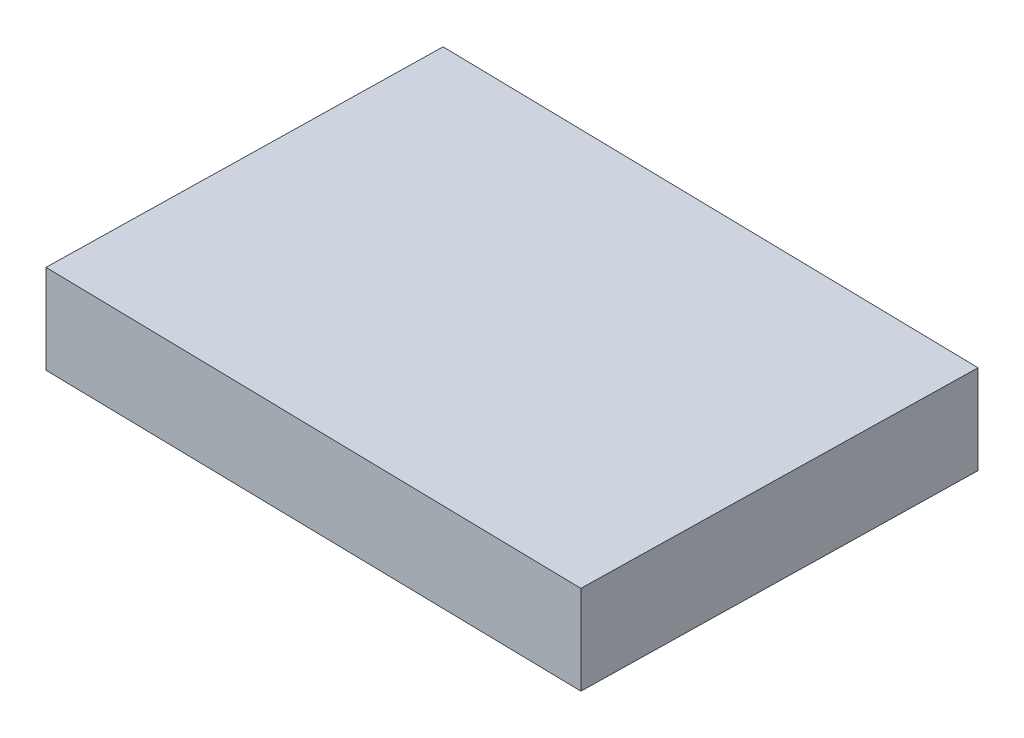
ISO-10303-21;
HEADER;
FILE_DESCRIPTION(('STEP AP214'),'2;1');
FILE_NAME('part.step','',(''),(''),'','','');
FILE_SCHEMA(('AUTOMOTIVE_DESIGN { 1 0 10303 214 1 1 1 1 }'));
ENDSEC;
DATA;
#1=APPLICATION_CONTEXT('core data for automotive mechanical design processes');
#2=APPLICATION_PROTOCOL_DEFINITION('international standard','automotive_design',2000,#1);
#3=PRODUCT_CONTEXT('',#1,'mechanical');
#4=PRODUCT('Part','Part','',(#3));
#5=PRODUCT_RELATED_PRODUCT_CATEGORY('part','',(#4));
#6=PRODUCT_DEFINITION_FORMATION('','',#4);
#7=PRODUCT_DEFINITION_CONTEXT('part definition',#1,'design');
#8=PRODUCT_DEFINITION('design','',#6,#7);
#9=PRODUCT_DEFINITION_SHAPE('','',#8);
#10=(LENGTH_UNIT() NAMED_UNIT(*) SI_UNIT(.MILLI.,.METRE.));
#11=(NAMED_UNIT(*) PLANE_ANGLE_UNIT() SI_UNIT($,.RADIAN.));
#12=(NAMED_UNIT(*) SI_UNIT($,.STERADIAN.) SOLID_ANGLE_UNIT());
#13=UNCERTAINTY_MEASURE_WITH_UNIT(LENGTH_MEASURE(1.E-05),#10,'distance_accuracy_value','');
#14=(GEOMETRIC_REPRESENTATION_CONTEXT(3) GLOBAL_UNCERTAINTY_ASSIGNED_CONTEXT((#13)) GLOBAL_UNIT_ASSIGNED_CONTEXT((#10,
#11,#12)) REPRESENTATION_CONTEXT('',''));
#15=CARTESIAN_POINT('',(0.,0.,0.));
#16=DIRECTION('',(0.,0.,1.));
#17=DIRECTION('',(1.,0.,0.));
#18=AXIS2_PLACEMENT_3D('',#15,#16,#17);
#19=CARTESIAN_POINT('',(-0.412651636419679,2.7686073292922,33.9801264372744));
#20=DIRECTION('',(0.,-1.,0.));
#21=DIRECTION('',(-1.,0.,0.));
#22=AXIS2_PLACEMENT_3D('',#19,#20,#21);
#23=PLANE('',#22);
#24=DIRECTION('',(0.0193548335692301,0.,-0.999812677663925));
#25=VECTOR('',#24,1.);
#26=CARTESIAN_POINT('',(-6.54845369430705,2.76860732929206,29.4155139557569));
#27=LINE('',#26,#25);
#28=CARTESIAN_POINT('',(-6.72051816473751,2.76860732929226,38.3038486601893));
#29=VERTEX_POINT('',#28);
#30=CARTESIAN_POINT('',(-6.54845369430707,2.76860732929201,29.4155139557569));
#31=VERTEX_POINT('',#30);
#32=EDGE_CURVE('E83',#29,#31,#27,.T.);
#33=ORIENTED_EDGE('',*,*,#32,.T.);
#34=DIRECTION('',(0.999812677663925,0.,0.0193548335692301));
#35=VECTOR('',#34,1.);
#36=CARTESIAN_POINT('',(5.89521489189809,2.76860732929194,29.6564042143596));
#37=LINE('',#36,#35);
#38=CARTESIAN_POINT('',(5.89521489189815,2.76860732929224,29.6564042143596));
#39=VERTEX_POINT('',#38);
#40=EDGE_CURVE('E59',#31,#39,#37,.T.);
#41=ORIENTED_EDGE('',*,*,#40,.T.);
#42=DIRECTION('',(-0.0193548335692301,0.,0.999812677663925));
#43=VECTOR('',#42,1.);
#44=CARTESIAN_POINT('',(5.89521489189815,2.76860732929234,29.6564042143595));
#45=LINE('',#44,#43);
#46=CARTESIAN_POINT('',(5.72315042146768,2.76860732929239,38.5447389187919));
#47=VERTEX_POINT('',#46);
#48=EDGE_CURVE('E20',#39,#47,#45,.T.);
#49=ORIENTED_EDGE('',*,*,#48,.T.);
#50=DIRECTION('',(-0.999812677663925,0.,-0.0193548335692301));
#51=VECTOR('',#50,1.);
#52=CARTESIAN_POINT('',(5.72315042146763,2.76860732929245,38.5447389187919));
#53=LINE('',#52,#51);
#54=EDGE_CURVE('E56',#47,#29,#53,.T.);
#55=ORIENTED_EDGE('',*,*,#54,.T.);
#56=EDGE_LOOP('',(#33,#41,#49,#55));
#57=FACE_BOUND('',#56,.T.);
#58=ADVANCED_FACE('F17',(#57),#23,.T.);
#59=CARTESIAN_POINT('',(5.89521489189809,4.80060732929234,29.6564042143595));
#60=DIRECTION('',(-0.999812677663925,0.,-0.0193548335692301));
#61=DIRECTION('',(-0.0193548335692301,0.,0.999812677663925));
#62=AXIS2_PLACEMENT_3D('',#59,#60,#61);
#63=PLANE('',#62);
#64=ORIENTED_EDGE('',*,*,#48,.F.);
#65=DIRECTION('',(0.,1.,0.));
#66=VECTOR('',#65,1.);
#67=CARTESIAN_POINT('',(5.89521489189815,4.80060732929234,29.6564042143595));
#68=LINE('',#67,#66);
#69=CARTESIAN_POINT('',(5.8952148918981,4.8006073292924,29.6564042143595));
#70=VERTEX_POINT('',#69);
#71=EDGE_CURVE('E90',#39,#70,#68,.T.);
#72=ORIENTED_EDGE('',*,*,#71,.T.);
#73=DIRECTION('',(-0.0193548335692302,0.,0.999812677663925));
#74=VECTOR('',#73,1.);
#75=CARTESIAN_POINT('',(5.89521489189809,4.80060732929234,29.6564042143595));
#76=LINE('',#75,#74);
#77=CARTESIAN_POINT('',(5.72315042146763,4.80060732929236,38.5447389187919));
#78=VERTEX_POINT('',#77);
#79=EDGE_CURVE('E76',#70,#78,#76,.T.);
#80=ORIENTED_EDGE('',*,*,#79,.T.);
#81=DIRECTION('',(0.,1.,0.));
#82=VECTOR('',#81,1.);
#83=CARTESIAN_POINT('',(5.72315042146763,4.80060732929247,38.5447389187919));
#84=LINE('',#83,#82);
#85=EDGE_CURVE('E65',#78,#47,#84,.F.);
#86=ORIENTED_EDGE('',*,*,#85,.T.);
#87=EDGE_LOOP('',(#64,#72,#80,#86));
#88=FACE_BOUND('',#87,.T.);
#89=ADVANCED_FACE('F75',(#88),#63,.F.);
#90=CARTESIAN_POINT('',(5.72315042146763,4.80060732929247,38.5447389187919));
#91=DIRECTION('',(0.0193548335692301,0.,-0.999812677663925));
#92=DIRECTION('',(-0.999812677663925,0.,-0.0193548335692301));
#93=AXIS2_PLACEMENT_3D('',#90,#91,#92);
#94=PLANE('',#93);
#95=ORIENTED_EDGE('',*,*,#54,.F.);
#96=ORIENTED_EDGE('',*,*,#85,.F.);
#97=DIRECTION('',(-0.999812677663925,0.,-0.0193548335692301));
#98=VECTOR('',#97,1.);
#99=CARTESIAN_POINT('',(5.72315042146763,4.80060732929245,38.5447389187919));
#100=LINE('',#99,#98);
#101=CARTESIAN_POINT('',(-6.72051816473754,4.80060732929202,38.3038486601892));
#102=VERTEX_POINT('',#101);
#103=EDGE_CURVE('E95',#78,#102,#100,.T.);
#104=ORIENTED_EDGE('',*,*,#103,.T.);
#105=DIRECTION('',(0.,1.,0.));
#106=VECTOR('',#105,1.);
#107=CARTESIAN_POINT('',(-6.72051816473758,4.80060732929194,38.3038486601892));
#108=LINE('',#107,#106);
#109=EDGE_CURVE('E71',#102,#29,#108,.F.);
#110=ORIENTED_EDGE('',*,*,#109,.T.);
#111=EDGE_LOOP('',(#95,#96,#104,#110));
#112=FACE_BOUND('',#111,.T.);
#113=ADVANCED_FACE('F68',(#112),#94,.F.);
#114=CARTESIAN_POINT('',(-6.54845369430712,4.80060732929194,29.4155139557569));
#115=DIRECTION('',(0.999812677663925,0.,0.0193548335692301));
#116=DIRECTION('',(0.0193548335692301,0.,-0.999812677663925));
#117=AXIS2_PLACEMENT_3D('',#114,#115,#116);
#118=PLANE('',#117);
#119=ORIENTED_EDGE('',*,*,#32,.F.);
#120=ORIENTED_EDGE('',*,*,#109,.F.);
#121=DIRECTION('',(0.0193548335692302,0.,-0.999812677663925));
#122=VECTOR('',#121,1.);
#123=CARTESIAN_POINT('',(-6.72051816473758,4.80060732929206,38.3038486601892));
#124=LINE('',#123,#122);
#125=CARTESIAN_POINT('',(-6.54845369430712,4.80060732929204,29.4155139557569));
#126=VERTEX_POINT('',#125);
#127=EDGE_CURVE('E27',#102,#126,#124,.T.);
#128=ORIENTED_EDGE('',*,*,#127,.T.);
#129=DIRECTION('',(0.,1.,0.));
#130=VECTOR('',#129,1.);
#131=CARTESIAN_POINT('',(-6.54845369430712,4.80060732929234,29.4155139557569));
#132=LINE('',#131,#130);
#133=EDGE_CURVE('E35',#126,#31,#132,.F.);
#134=ORIENTED_EDGE('',*,*,#133,.T.);
#135=EDGE_LOOP('',(#119,#120,#128,#134));
#136=FACE_BOUND('',#135,.T.);
#137=ADVANCED_FACE('F101',(#136),#118,.F.);
#138=CARTESIAN_POINT('',(5.89521489189809,4.80060732929234,29.6564042143595));
#139=DIRECTION('',(-0.0193548335692301,0.,0.999812677663925));
#140=DIRECTION('',(0.999812677663925,0.,0.0193548335692301));
#141=AXIS2_PLACEMENT_3D('',#138,#139,#140);
#142=PLANE('',#141);
#143=ORIENTED_EDGE('',*,*,#40,.F.);
#144=ORIENTED_EDGE('',*,*,#133,.F.);
#145=DIRECTION('',(0.999812677663925,0.,0.0193548335692301));
#146=VECTOR('',#145,1.);
#147=CARTESIAN_POINT('',(-6.54845369430712,4.80060732929194,29.4155139557569));
#148=LINE('',#147,#146);
#149=EDGE_CURVE('E11',#126,#70,#148,.T.);
#150=ORIENTED_EDGE('',*,*,#149,.T.);
#151=ORIENTED_EDGE('',*,*,#71,.F.);
#152=EDGE_LOOP('',(#143,#144,#150,#151));
#153=FACE_BOUND('',#152,.T.);
#154=ADVANCED_FACE('F104',(#153),#142,.F.);
#155=CARTESIAN_POINT('',(-0.412651636419744,4.8006073292922,33.9801264372744));
#156=DIRECTION('',(0.,-1.,0.));
#157=DIRECTION('',(-1.,0.,0.));
#158=AXIS2_PLACEMENT_3D('',#155,#156,#157);
#159=PLANE('',#158);
#160=ORIENTED_EDGE('',*,*,#127,.F.);
#161=ORIENTED_EDGE('',*,*,#103,.F.);
#162=ORIENTED_EDGE('',*,*,#79,.F.);
#163=ORIENTED_EDGE('',*,*,#149,.F.);
#164=EDGE_LOOP('',(#160,#161,#162,#163));
#165=FACE_BOUND('',#164,.T.);
#166=ADVANCED_FACE('F103',(#165),#159,.F.);
#167=CLOSED_SHELL('',(#58,#89,#113,#137,#154,#166));
#168=MANIFOLD_SOLID_BREP('B1',#167);
#169=ADVANCED_BREP_SHAPE_REPRESENTATION('',(#18,#168),#14);
#170=SHAPE_DEFINITION_REPRESENTATION(#9,#169);
ENDSEC;
END-ISO-10303-21;
